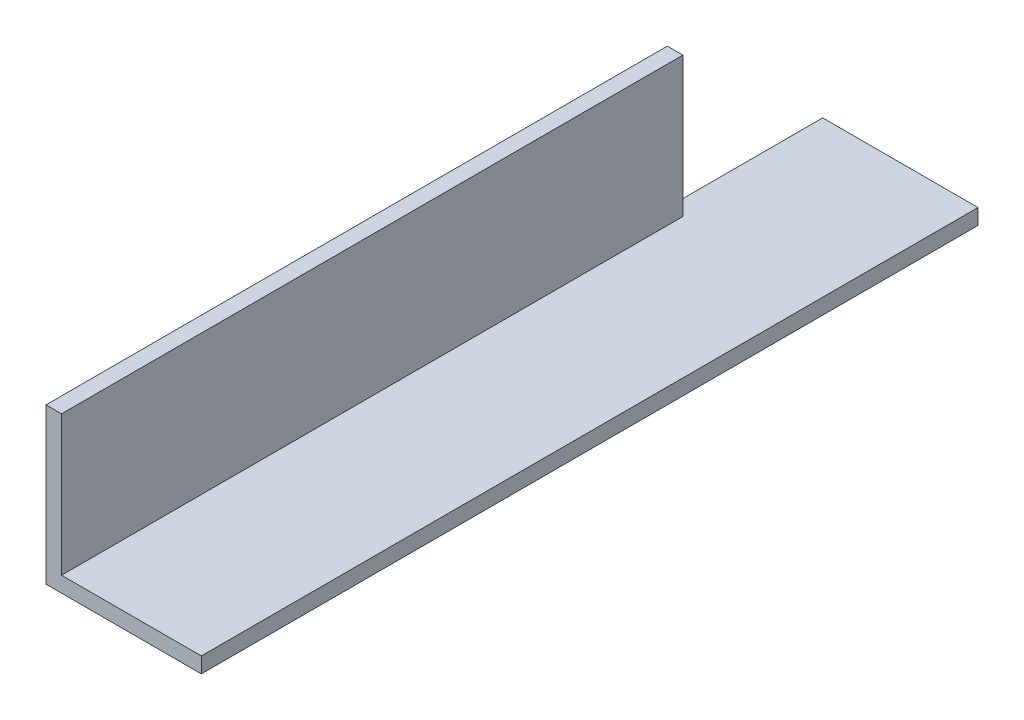
ISO-10303-21;
HEADER;
FILE_DESCRIPTION(('STEP AP214'),'2;1');
FILE_NAME('part.step','',(''),(''),'','','');
FILE_SCHEMA(('AUTOMOTIVE_DESIGN { 1 0 10303 214 1 1 1 1 }'));
ENDSEC;
DATA;
#1=APPLICATION_CONTEXT('core data for automotive mechanical design processes');
#2=APPLICATION_PROTOCOL_DEFINITION('international standard','automotive_design',2000,#1);
#3=PRODUCT_CONTEXT('',#1,'mechanical');
#4=PRODUCT('Part','Part','',(#3));
#5=PRODUCT_RELATED_PRODUCT_CATEGORY('part','',(#4));
#6=PRODUCT_DEFINITION_FORMATION('','',#4);
#7=PRODUCT_DEFINITION_CONTEXT('part definition',#1,'design');
#8=PRODUCT_DEFINITION('design','',#6,#7);
#9=PRODUCT_DEFINITION_SHAPE('','',#8);
#10=(LENGTH_UNIT() NAMED_UNIT(*) SI_UNIT(.MILLI.,.METRE.));
#11=(NAMED_UNIT(*) PLANE_ANGLE_UNIT() SI_UNIT($,.RADIAN.));
#12=(NAMED_UNIT(*) SI_UNIT($,.STERADIAN.) SOLID_ANGLE_UNIT());
#13=UNCERTAINTY_MEASURE_WITH_UNIT(LENGTH_MEASURE(1.E-05),#10,'distance_accuracy_value','');
#14=(GEOMETRIC_REPRESENTATION_CONTEXT(3) GLOBAL_UNCERTAINTY_ASSIGNED_CONTEXT((#13)) GLOBAL_UNIT_ASSIGNED_CONTEXT((#10,
#11,#12)) REPRESENTATION_CONTEXT('',''));
#15=CARTESIAN_POINT('',(0.,0.,0.));
#16=DIRECTION('',(0.,0.,1.));
#17=DIRECTION('',(1.,0.,0.));
#18=AXIS2_PLACEMENT_3D('',#15,#16,#17);
#19=CARTESIAN_POINT('',(0.,0.,100.));
#20=DIRECTION('',(0.,1.,0.));
#21=DIRECTION('',(0.,0.,1.));
#22=AXIS2_PLACEMENT_3D('',#19,#20,#21);
#23=PLANE('',#22);
#24=DIRECTION('',(1.,0.,0.));
#25=VECTOR('',#24,1.);
#26=CARTESIAN_POINT('',(0.,0.,0.));
#27=LINE('',#26,#25);
#28=CARTESIAN_POINT('',(0.,0.,0.));
#29=VERTEX_POINT('',#28);
#30=CARTESIAN_POINT('',(20.,0.,0.));
#31=VERTEX_POINT('',#30);
#32=EDGE_CURVE('E116',#29,#31,#27,.T.);
#33=ORIENTED_EDGE('',*,*,#32,.T.);
#34=DIRECTION('',(0.,0.,-1.));
#35=VECTOR('',#34,1.);
#36=CARTESIAN_POINT('',(20.,0.,100.));
#37=LINE('',#36,#35);
#38=CARTESIAN_POINT('',(20.,0.,100.));
#39=VERTEX_POINT('',#38);
#40=EDGE_CURVE('E11',#39,#31,#37,.T.);
#41=ORIENTED_EDGE('',*,*,#40,.F.);
#42=DIRECTION('',(1.,0.,0.));
#43=VECTOR('',#42,1.);
#44=CARTESIAN_POINT('',(0.,0.,100.));
#45=LINE('',#44,#43);
#46=CARTESIAN_POINT('',(0.,0.,100.));
#47=VERTEX_POINT('',#46);
#48=EDGE_CURVE('E125',#47,#39,#45,.T.);
#49=ORIENTED_EDGE('',*,*,#48,.F.);
#50=DIRECTION('',(0.,0.,-1.));
#51=VECTOR('',#50,1.);
#52=CARTESIAN_POINT('',(0.,0.,100.));
#53=LINE('',#52,#51);
#54=EDGE_CURVE('E112',#47,#29,#53,.T.);
#55=ORIENTED_EDGE('',*,*,#54,.T.);
#56=EDGE_LOOP('',(#33,#41,#49,#55));
#57=FACE_BOUND('',#56,.T.);
#58=ADVANCED_FACE('F33',(#57),#23,.F.);
#59=CARTESIAN_POINT('',(20.,0.,100.));
#60=DIRECTION('',(-1.,0.,0.));
#61=DIRECTION('',(0.,0.,1.));
#62=AXIS2_PLACEMENT_3D('',#59,#60,#61);
#63=PLANE('',#62);
#64=DIRECTION('',(0.,1.,0.));
#65=VECTOR('',#64,1.);
#66=CARTESIAN_POINT('',(20.,0.,0.));
#67=LINE('',#66,#65);
#68=CARTESIAN_POINT('',(20.,2.,0.));
#69=VERTEX_POINT('',#68);
#70=EDGE_CURVE('E62',#31,#69,#67,.T.);
#71=ORIENTED_EDGE('',*,*,#70,.T.);
#72=DIRECTION('',(0.,0.,-1.));
#73=VECTOR('',#72,1.);
#74=CARTESIAN_POINT('',(20.,2.,100.));
#75=LINE('',#74,#73);
#76=CARTESIAN_POINT('',(20.,2.,100.));
#77=VERTEX_POINT('',#76);
#78=EDGE_CURVE('E41',#77,#69,#75,.T.);
#79=ORIENTED_EDGE('',*,*,#78,.F.);
#80=DIRECTION('',(0.,1.,0.));
#81=VECTOR('',#80,1.);
#82=CARTESIAN_POINT('',(20.,0.,100.));
#83=LINE('',#82,#81);
#84=EDGE_CURVE('E75',#39,#77,#83,.T.);
#85=ORIENTED_EDGE('',*,*,#84,.F.);
#86=ORIENTED_EDGE('',*,*,#40,.T.);
#87=EDGE_LOOP('',(#71,#79,#85,#86));
#88=FACE_BOUND('',#87,.T.);
#89=ADVANCED_FACE('F161',(#88),#63,.F.);
#90=CARTESIAN_POINT('',(2.,2.,100.));
#91=DIRECTION('',(0.,-1.,0.));
#92=DIRECTION('',(0.,0.,-1.));
#93=AXIS2_PLACEMENT_3D('',#90,#91,#92);
#94=PLANE('',#93);
#95=DIRECTION('',(-1.,0.,0.));
#96=VECTOR('',#95,1.);
#97=CARTESIAN_POINT('',(2.,2.,0.));
#98=LINE('',#97,#96);
#99=CARTESIAN_POINT('',(0.,2.,0.));
#100=VERTEX_POINT('',#99);
#101=EDGE_CURVE('E121',#69,#100,#98,.T.);
#102=ORIENTED_EDGE('',*,*,#101,.T.);
#103=DIRECTION('',(0.,0.,-1.));
#104=VECTOR('',#103,1.);
#105=CARTESIAN_POINT('',(0.,2.,0.));
#106=LINE('',#105,#104);
#107=CARTESIAN_POINT('',(0.,2.,20.));
#108=VERTEX_POINT('',#107);
#109=EDGE_CURVE('E149',#108,#100,#106,.T.);
#110=ORIENTED_EDGE('',*,*,#109,.F.);
#111=DIRECTION('',(1.,0.,0.));
#112=VECTOR('',#111,1.);
#113=CARTESIAN_POINT('',(0.,2.,20.));
#114=LINE('',#113,#112);
#115=CARTESIAN_POINT('',(2.,2.,20.));
#116=VERTEX_POINT('',#115);
#117=EDGE_CURVE('E119',#108,#116,#114,.T.);
#118=ORIENTED_EDGE('',*,*,#117,.T.);
#119=DIRECTION('',(0.,0.,-1.));
#120=VECTOR('',#119,1.);
#121=CARTESIAN_POINT('',(2.,2.,100.));
#122=LINE('',#121,#120);
#123=CARTESIAN_POINT('',(2.,2.,100.));
#124=VERTEX_POINT('',#123);
#125=EDGE_CURVE('E106',#124,#116,#122,.T.);
#126=ORIENTED_EDGE('',*,*,#125,.F.);
#127=DIRECTION('',(-1.,0.,0.));
#128=VECTOR('',#127,1.);
#129=CARTESIAN_POINT('',(2.,2.,100.));
#130=LINE('',#129,#128);
#131=EDGE_CURVE('E92',#77,#124,#130,.T.);
#132=ORIENTED_EDGE('',*,*,#131,.F.);
#133=ORIENTED_EDGE('',*,*,#78,.T.);
#134=EDGE_LOOP('',(#102,#110,#118,#126,#132,#133));
#135=FACE_BOUND('',#134,.T.);
#136=ADVANCED_FACE('F130',(#135),#94,.F.);
#137=CARTESIAN_POINT('',(2.,2.,100.));
#138=DIRECTION('',(-1.,0.,0.));
#139=DIRECTION('',(0.,0.,1.));
#140=AXIS2_PLACEMENT_3D('',#137,#138,#139);
#141=PLANE('',#140);
#142=ORIENTED_EDGE('',*,*,#125,.T.);
#143=DIRECTION('',(0.,-1.,0.));
#144=VECTOR('',#143,1.);
#145=CARTESIAN_POINT('',(2.,2.,20.));
#146=LINE('',#145,#144);
#147=CARTESIAN_POINT('',(2.,20.,20.));
#148=VERTEX_POINT('',#147);
#149=EDGE_CURVE('E103',#148,#116,#146,.T.);
#150=ORIENTED_EDGE('',*,*,#149,.F.);
#151=DIRECTION('',(0.,0.,-1.));
#152=VECTOR('',#151,1.);
#153=CARTESIAN_POINT('',(2.,20.,100.));
#154=LINE('',#153,#152);
#155=CARTESIAN_POINT('',(2.,20.,100.));
#156=VERTEX_POINT('',#155);
#157=EDGE_CURVE('E99',#156,#148,#154,.T.);
#158=ORIENTED_EDGE('',*,*,#157,.F.);
#159=DIRECTION('',(0.,1.,0.));
#160=VECTOR('',#159,1.);
#161=CARTESIAN_POINT('',(2.,2.,100.));
#162=LINE('',#161,#160);
#163=EDGE_CURVE('E85',#124,#156,#162,.T.);
#164=ORIENTED_EDGE('',*,*,#163,.F.);
#165=EDGE_LOOP('',(#142,#150,#158,#164));
#166=FACE_BOUND('',#165,.T.);
#167=ADVANCED_FACE('F100',(#166),#141,.F.);
#168=CARTESIAN_POINT('',(0.,20.,100.));
#169=DIRECTION('',(0.,-1.,0.));
#170=DIRECTION('',(0.,0.,-1.));
#171=AXIS2_PLACEMENT_3D('',#168,#169,#170);
#172=PLANE('',#171);
#173=ORIENTED_EDGE('',*,*,#157,.T.);
#174=DIRECTION('',(1.,0.,0.));
#175=VECTOR('',#174,1.);
#176=CARTESIAN_POINT('',(0.,20.,20.));
#177=LINE('',#176,#175);
#178=CARTESIAN_POINT('',(0.,20.,20.));
#179=VERTEX_POINT('',#178);
#180=EDGE_CURVE('E144',#179,#148,#177,.T.);
#181=ORIENTED_EDGE('',*,*,#180,.F.);
#182=DIRECTION('',(0.,0.,-1.));
#183=VECTOR('',#182,1.);
#184=CARTESIAN_POINT('',(0.,20.,100.));
#185=LINE('',#184,#183);
#186=CARTESIAN_POINT('',(0.,20.,100.));
#187=VERTEX_POINT('',#186);
#188=EDGE_CURVE('E107',#187,#179,#185,.T.);
#189=ORIENTED_EDGE('',*,*,#188,.F.);
#190=DIRECTION('',(-1.,0.,0.));
#191=VECTOR('',#190,1.);
#192=CARTESIAN_POINT('',(0.,20.,100.));
#193=LINE('',#192,#191);
#194=EDGE_CURVE('E89',#156,#187,#193,.T.);
#195=ORIENTED_EDGE('',*,*,#194,.F.);
#196=EDGE_LOOP('',(#173,#181,#189,#195));
#197=FACE_BOUND('',#196,.T.);
#198=ADVANCED_FACE('F109',(#197),#172,.F.);
#199=CARTESIAN_POINT('',(0.,0.,100.));
#200=DIRECTION('',(1.,0.,0.));
#201=DIRECTION('',(0.,0.,-1.));
#202=AXIS2_PLACEMENT_3D('',#199,#200,#201);
#203=PLANE('',#202);
#204=DIRECTION('',(0.,-1.,0.));
#205=VECTOR('',#204,1.);
#206=CARTESIAN_POINT('',(0.,2.,20.));
#207=LINE('',#206,#205);
#208=EDGE_CURVE('E147',#179,#108,#207,.T.);
#209=ORIENTED_EDGE('',*,*,#208,.T.);
#210=ORIENTED_EDGE('',*,*,#109,.T.);
#211=DIRECTION('',(0.,-1.,0.));
#212=VECTOR('',#211,1.);
#213=CARTESIAN_POINT('',(0.,0.,0.));
#214=LINE('',#213,#212);
#215=EDGE_CURVE('E69',#100,#29,#214,.T.);
#216=ORIENTED_EDGE('',*,*,#215,.T.);
#217=ORIENTED_EDGE('',*,*,#54,.F.);
#218=DIRECTION('',(0.,-1.,0.));
#219=VECTOR('',#218,1.);
#220=CARTESIAN_POINT('',(0.,0.,100.));
#221=LINE('',#220,#219);
#222=EDGE_CURVE('E49',#187,#47,#221,.T.);
#223=ORIENTED_EDGE('',*,*,#222,.F.);
#224=ORIENTED_EDGE('',*,*,#188,.T.);
#225=EDGE_LOOP('',(#209,#210,#216,#217,#223,#224));
#226=FACE_BOUND('',#225,.T.);
#227=ADVANCED_FACE('F152',(#226),#203,.F.);
#228=CARTESIAN_POINT('',(0.,0.,100.));
#229=DIRECTION('',(0.,0.,1.));
#230=DIRECTION('',(1.,0.,0.));
#231=AXIS2_PLACEMENT_3D('',#228,#229,#230);
#232=PLANE('',#231);
#233=ORIENTED_EDGE('',*,*,#48,.T.);
#234=ORIENTED_EDGE('',*,*,#84,.T.);
#235=ORIENTED_EDGE('',*,*,#131,.T.);
#236=ORIENTED_EDGE('',*,*,#163,.T.);
#237=ORIENTED_EDGE('',*,*,#194,.T.);
#238=ORIENTED_EDGE('',*,*,#222,.T.);
#239=EDGE_LOOP('',(#233,#234,#235,#236,#237,#238));
#240=FACE_BOUND('',#239,.T.);
#241=ADVANCED_FACE('F87',(#240),#232,.T.);
#242=CARTESIAN_POINT('',(0.,0.,0.));
#243=DIRECTION('',(0.,0.,1.));
#244=DIRECTION('',(1.,0.,0.));
#245=AXIS2_PLACEMENT_3D('',#242,#243,#244);
#246=PLANE('',#245);
#247=ORIENTED_EDGE('',*,*,#215,.F.);
#248=ORIENTED_EDGE('',*,*,#101,.F.);
#249=ORIENTED_EDGE('',*,*,#70,.F.);
#250=ORIENTED_EDGE('',*,*,#32,.F.);
#251=EDGE_LOOP('',(#247,#248,#249,#250));
#252=FACE_BOUND('',#251,.T.);
#253=ADVANCED_FACE('F133',(#252),#246,.F.);
#254=CARTESIAN_POINT('',(0.,2.,20.));
#255=DIRECTION('',(0.,0.,1.));
#256=DIRECTION('',(0.,-1.,0.));
#257=AXIS2_PLACEMENT_3D('',#254,#255,#256);
#258=PLANE('',#257);
#259=ORIENTED_EDGE('',*,*,#149,.T.);
#260=ORIENTED_EDGE('',*,*,#117,.F.);
#261=ORIENTED_EDGE('',*,*,#208,.F.);
#262=ORIENTED_EDGE('',*,*,#180,.T.);
#263=EDGE_LOOP('',(#259,#260,#261,#262));
#264=FACE_BOUND('',#263,.T.);
#265=ADVANCED_FACE('F148',(#264),#258,.F.);
#266=CLOSED_SHELL('',(#58,#89,#136,#167,#198,#227,#241,#253,#265));
#267=MANIFOLD_SOLID_BREP('B2',#266);
#268=ADVANCED_BREP_SHAPE_REPRESENTATION('',(#18,#267),#14);
#269=SHAPE_DEFINITION_REPRESENTATION(#9,#268);
ENDSEC;
END-ISO-10303-21;
